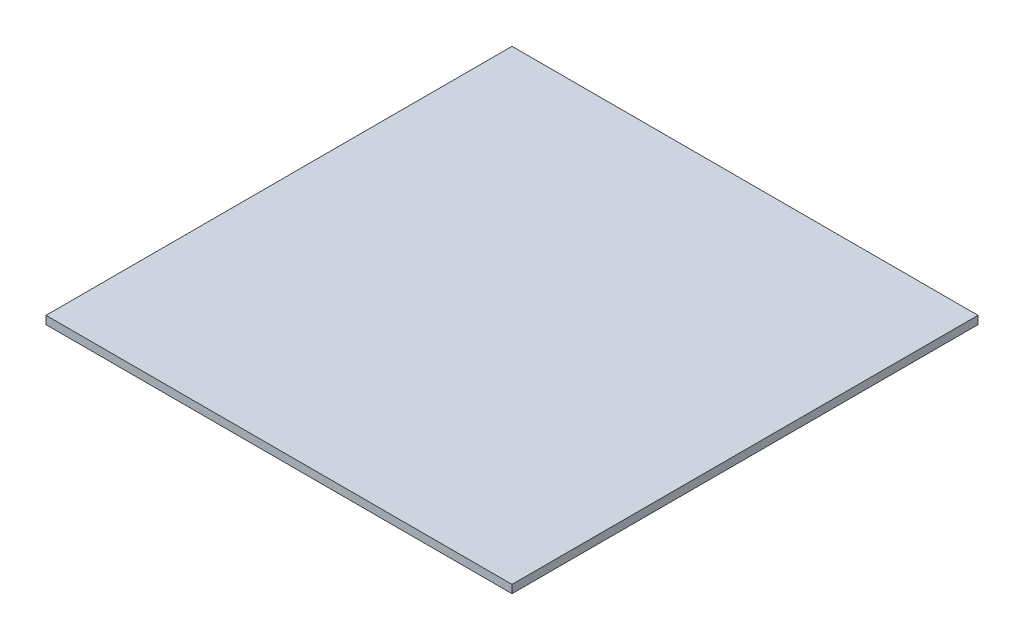
ISO-10303-21;
HEADER;
FILE_DESCRIPTION(('STEP AP214'),'2;1');
FILE_NAME('part.step','',(''),(''),'','','');
FILE_SCHEMA(('AUTOMOTIVE_DESIGN { 1 0 10303 214 1 1 1 1 }'));
ENDSEC;
DATA;
#1=APPLICATION_CONTEXT('core data for automotive mechanical design processes');
#2=APPLICATION_PROTOCOL_DEFINITION('international standard','automotive_design',2000,#1);
#3=PRODUCT_CONTEXT('',#1,'mechanical');
#4=PRODUCT('Part','Part','',(#3));
#5=PRODUCT_RELATED_PRODUCT_CATEGORY('part','',(#4));
#6=PRODUCT_DEFINITION_FORMATION('','',#4);
#7=PRODUCT_DEFINITION_CONTEXT('part definition',#1,'design');
#8=PRODUCT_DEFINITION('design','',#6,#7);
#9=PRODUCT_DEFINITION_SHAPE('','',#8);
#10=(LENGTH_UNIT() NAMED_UNIT(*) SI_UNIT(.MILLI.,.METRE.));
#11=(NAMED_UNIT(*) PLANE_ANGLE_UNIT() SI_UNIT($,.RADIAN.));
#12=(NAMED_UNIT(*) SI_UNIT($,.STERADIAN.) SOLID_ANGLE_UNIT());
#13=UNCERTAINTY_MEASURE_WITH_UNIT(LENGTH_MEASURE(1.E-05),#10,'distance_accuracy_value','');
#14=(GEOMETRIC_REPRESENTATION_CONTEXT(3) GLOBAL_UNCERTAINTY_ASSIGNED_CONTEXT((#13)) GLOBAL_UNIT_ASSIGNED_CONTEXT((#10,
#11,#12)) REPRESENTATION_CONTEXT('',''));
#15=CARTESIAN_POINT('',(0.,0.,0.));
#16=DIRECTION('',(0.,0.,1.));
#17=DIRECTION('',(1.,0.,0.));
#18=AXIS2_PLACEMENT_3D('',#15,#16,#17);
#19=CARTESIAN_POINT('',(0.,1.8,0.));
#20=DIRECTION('',(1.,0.,0.));
#21=DIRECTION('',(0.,0.,-1.));
#22=AXIS2_PLACEMENT_3D('',#19,#20,#21);
#23=PLANE('',#22);
#24=DIRECTION('',(0.,0.,1.));
#25=VECTOR('',#24,1.);
#26=CARTESIAN_POINT('',(0.,0.,0.));
#27=LINE('',#26,#25);
#28=CARTESIAN_POINT('',(0.,0.,-103.6));
#29=VERTEX_POINT('',#28);
#30=CARTESIAN_POINT('',(0.,0.,0.));
#31=VERTEX_POINT('',#30);
#32=EDGE_CURVE('E98',#29,#31,#27,.T.);
#33=ORIENTED_EDGE('',*,*,#32,.T.);
#34=DIRECTION('',(0.,-1.,0.));
#35=VECTOR('',#34,1.);
#36=CARTESIAN_POINT('',(0.,1.8,0.));
#37=LINE('',#36,#35);
#38=CARTESIAN_POINT('',(0.,1.8,0.));
#39=VERTEX_POINT('',#38);
#40=EDGE_CURVE('E11',#39,#31,#37,.T.);
#41=ORIENTED_EDGE('',*,*,#40,.F.);
#42=DIRECTION('',(0.,0.,1.));
#43=VECTOR('',#42,1.);
#44=CARTESIAN_POINT('',(0.,1.8,0.));
#45=LINE('',#44,#43);
#46=CARTESIAN_POINT('',(0.,1.8,-103.6));
#47=VERTEX_POINT('',#46);
#48=EDGE_CURVE('E86',#47,#39,#45,.T.);
#49=ORIENTED_EDGE('',*,*,#48,.F.);
#50=DIRECTION('',(0.,-1.,0.));
#51=VECTOR('',#50,1.);
#52=CARTESIAN_POINT('',(0.,1.8,-103.6));
#53=LINE('',#52,#51);
#54=EDGE_CURVE('E94',#47,#29,#53,.T.);
#55=ORIENTED_EDGE('',*,*,#54,.T.);
#56=EDGE_LOOP('',(#33,#41,#49,#55));
#57=FACE_BOUND('',#56,.T.);
#58=ADVANCED_FACE('F35',(#57),#23,.F.);
#59=CARTESIAN_POINT('',(0.,1.8,0.));
#60=DIRECTION('',(0.,0.,-1.));
#61=DIRECTION('',(-1.,0.,0.));
#62=AXIS2_PLACEMENT_3D('',#59,#60,#61);
#63=PLANE('',#62);
#64=DIRECTION('',(1.,0.,0.));
#65=VECTOR('',#64,1.);
#66=CARTESIAN_POINT('',(0.,0.,0.));
#67=LINE('',#66,#65);
#68=CARTESIAN_POINT('',(103.6,0.,0.));
#69=VERTEX_POINT('',#68);
#70=EDGE_CURVE('E90',#31,#69,#67,.T.);
#71=ORIENTED_EDGE('',*,*,#70,.T.);
#72=DIRECTION('',(0.,-1.,0.));
#73=VECTOR('',#72,1.);
#74=CARTESIAN_POINT('',(103.6,1.8,0.));
#75=LINE('',#74,#73);
#76=CARTESIAN_POINT('',(103.6,1.8,0.));
#77=VERTEX_POINT('',#76);
#78=EDGE_CURVE('E43',#77,#69,#75,.T.);
#79=ORIENTED_EDGE('',*,*,#78,.F.);
#80=DIRECTION('',(1.,0.,0.));
#81=VECTOR('',#80,1.);
#82=CARTESIAN_POINT('',(0.,1.8,0.));
#83=LINE('',#82,#81);
#84=EDGE_CURVE('E81',#39,#77,#83,.T.);
#85=ORIENTED_EDGE('',*,*,#84,.F.);
#86=ORIENTED_EDGE('',*,*,#40,.T.);
#87=EDGE_LOOP('',(#71,#79,#85,#86));
#88=FACE_BOUND('',#87,.T.);
#89=ADVANCED_FACE('F89',(#88),#63,.F.);
#90=CARTESIAN_POINT('',(103.6,1.8,0.));
#91=DIRECTION('',(-1.,0.,0.));
#92=DIRECTION('',(0.,0.,1.));
#93=AXIS2_PLACEMENT_3D('',#90,#91,#92);
#94=PLANE('',#93);
#95=DIRECTION('',(0.,0.,-1.));
#96=VECTOR('',#95,1.);
#97=CARTESIAN_POINT('',(103.6,0.,0.));
#98=LINE('',#97,#96);
#99=CARTESIAN_POINT('',(103.6,0.,-103.6));
#100=VERTEX_POINT('',#99);
#101=EDGE_CURVE('E68',#69,#100,#98,.T.);
#102=ORIENTED_EDGE('',*,*,#101,.T.);
#103=DIRECTION('',(0.,-1.,0.));
#104=VECTOR('',#103,1.);
#105=CARTESIAN_POINT('',(103.6,1.8,-103.6));
#106=LINE('',#105,#104);
#107=CARTESIAN_POINT('',(103.6,1.8,-103.6));
#108=VERTEX_POINT('',#107);
#109=EDGE_CURVE('E91',#108,#100,#106,.T.);
#110=ORIENTED_EDGE('',*,*,#109,.F.);
#111=DIRECTION('',(0.,0.,-1.));
#112=VECTOR('',#111,1.);
#113=CARTESIAN_POINT('',(103.6,1.8,0.));
#114=LINE('',#113,#112);
#115=EDGE_CURVE('E84',#77,#108,#114,.T.);
#116=ORIENTED_EDGE('',*,*,#115,.F.);
#117=ORIENTED_EDGE('',*,*,#78,.T.);
#118=EDGE_LOOP('',(#102,#110,#116,#117));
#119=FACE_BOUND('',#118,.T.);
#120=ADVANCED_FACE('F92',(#119),#94,.F.);
#121=CARTESIAN_POINT('',(0.,1.8,-103.6));
#122=DIRECTION('',(0.,0.,1.));
#123=DIRECTION('',(1.,0.,0.));
#124=AXIS2_PLACEMENT_3D('',#121,#122,#123);
#125=PLANE('',#124);
#126=DIRECTION('',(-1.,0.,0.));
#127=VECTOR('',#126,1.);
#128=CARTESIAN_POINT('',(0.,0.,-103.6));
#129=LINE('',#128,#127);
#130=EDGE_CURVE('E74',#100,#29,#129,.T.);
#131=ORIENTED_EDGE('',*,*,#130,.T.);
#132=ORIENTED_EDGE('',*,*,#54,.F.);
#133=DIRECTION('',(-1.,0.,0.));
#134=VECTOR('',#133,1.);
#135=CARTESIAN_POINT('',(0.,1.8,-103.6));
#136=LINE('',#135,#134);
#137=EDGE_CURVE('E51',#108,#47,#136,.T.);
#138=ORIENTED_EDGE('',*,*,#137,.F.);
#139=ORIENTED_EDGE('',*,*,#109,.T.);
#140=EDGE_LOOP('',(#131,#132,#138,#139));
#141=FACE_BOUND('',#140,.T.);
#142=ADVANCED_FACE('F105',(#141),#125,.F.);
#143=CARTESIAN_POINT('',(0.,1.8,0.));
#144=DIRECTION('',(0.,-1.,0.));
#145=DIRECTION('',(0.,0.,-1.));
#146=AXIS2_PLACEMENT_3D('',#143,#144,#145);
#147=PLANE('',#146);
#148=ORIENTED_EDGE('',*,*,#48,.T.);
#149=ORIENTED_EDGE('',*,*,#84,.T.);
#150=ORIENTED_EDGE('',*,*,#115,.T.);
#151=ORIENTED_EDGE('',*,*,#137,.T.);
#152=EDGE_LOOP('',(#148,#149,#150,#151));
#153=FACE_BOUND('',#152,.T.);
#154=ADVANCED_FACE('F82',(#153),#147,.F.);
#155=CARTESIAN_POINT('',(0.,0.,0.));
#156=DIRECTION('',(0.,-1.,0.));
#157=DIRECTION('',(0.,0.,-1.));
#158=AXIS2_PLACEMENT_3D('',#155,#156,#157);
#159=PLANE('',#158);
#160=ORIENTED_EDGE('',*,*,#32,.F.);
#161=ORIENTED_EDGE('',*,*,#130,.F.);
#162=ORIENTED_EDGE('',*,*,#101,.F.);
#163=ORIENTED_EDGE('',*,*,#70,.F.);
#164=EDGE_LOOP('',(#160,#161,#162,#163));
#165=FACE_BOUND('',#164,.T.);
#166=ADVANCED_FACE('F108',(#165),#159,.T.);
#167=CLOSED_SHELL('',(#58,#89,#120,#142,#154,#166));
#168=MANIFOLD_SOLID_BREP('B2',#167);
#169=ADVANCED_BREP_SHAPE_REPRESENTATION('',(#18,#168),#14);
#170=SHAPE_DEFINITION_REPRESENTATION(#9,#169);
ENDSEC;
END-ISO-10303-21;
